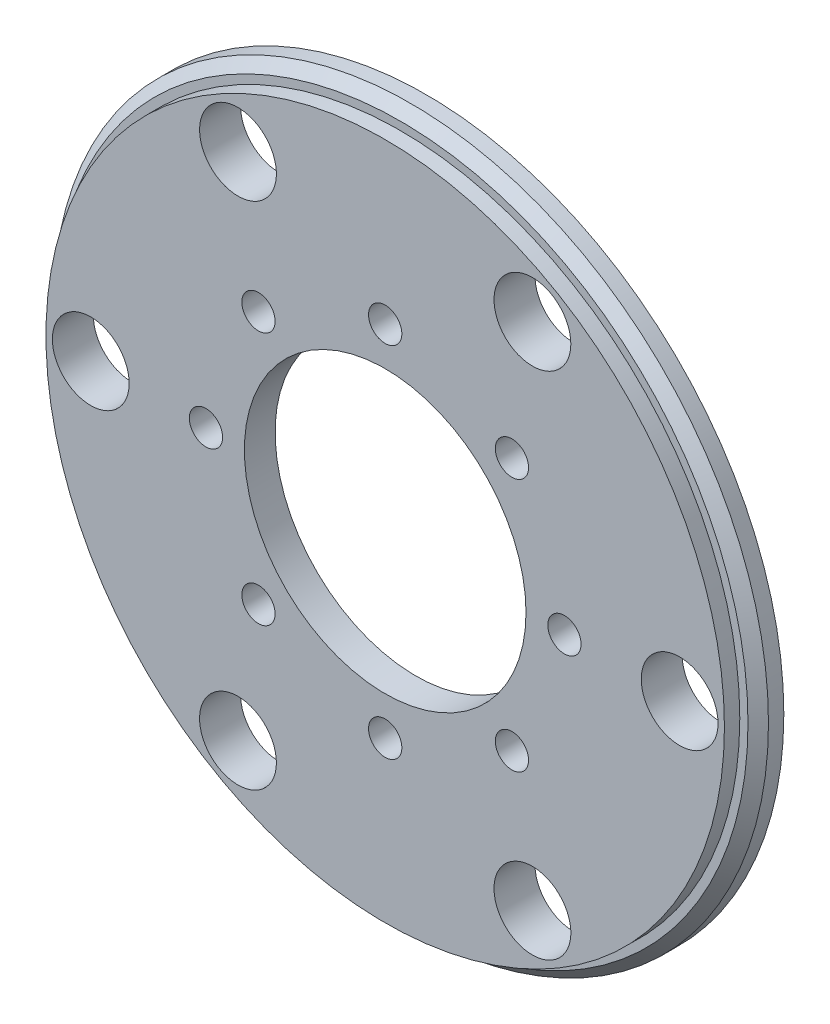
ISO-10303-21;
HEADER;
FILE_DESCRIPTION(('STEP AP214'),'2;1');
FILE_NAME('part.step','',(''),(''),'','','');
FILE_SCHEMA(('AUTOMOTIVE_DESIGN { 1 0 10303 214 1 1 1 1 }'));
ENDSEC;
DATA;
#1=APPLICATION_CONTEXT('core data for automotive mechanical design processes');
#2=APPLICATION_PROTOCOL_DEFINITION('international standard','automotive_design',2000,#1);
#3=PRODUCT_CONTEXT('',#1,'mechanical');
#4=PRODUCT('Part','Part','',(#3));
#5=PRODUCT_RELATED_PRODUCT_CATEGORY('part','',(#4));
#6=PRODUCT_DEFINITION_FORMATION('','',#4);
#7=PRODUCT_DEFINITION_CONTEXT('part definition',#1,'design');
#8=PRODUCT_DEFINITION('design','',#6,#7);
#9=PRODUCT_DEFINITION_SHAPE('','',#8);
#10=(LENGTH_UNIT() NAMED_UNIT(*) SI_UNIT(.MILLI.,.METRE.));
#11=(NAMED_UNIT(*) PLANE_ANGLE_UNIT() SI_UNIT($,.RADIAN.));
#12=(NAMED_UNIT(*) SI_UNIT($,.STERADIAN.) SOLID_ANGLE_UNIT());
#13=UNCERTAINTY_MEASURE_WITH_UNIT(LENGTH_MEASURE(1.E-05),#10,'distance_accuracy_value','');
#14=(GEOMETRIC_REPRESENTATION_CONTEXT(3) GLOBAL_UNCERTAINTY_ASSIGNED_CONTEXT((#13)) GLOBAL_UNIT_ASSIGNED_CONTEXT((#10,
#11,#12)) REPRESENTATION_CONTEXT('',''));
#15=CARTESIAN_POINT('',(0.,0.,0.));
#16=DIRECTION('',(0.,0.,1.));
#17=DIRECTION('',(1.,0.,0.));
#18=AXIS2_PLACEMENT_3D('',#15,#16,#17);
#19=CARTESIAN_POINT('',(0.,0.,-149.));
#20=DIRECTION('',(0.,0.,-1.));
#21=DIRECTION('',(-1.,0.,0.));
#22=AXIS2_PLACEMENT_3D('',#19,#20,#21);
#23=PLANE('',#22);
#24=CARTESIAN_POINT('',(-28.75,-49.796460717605,-149.));
#25=DIRECTION('',(0.,0.,1.));
#26=DIRECTION('',(1.,0.,0.));
#27=AXIS2_PLACEMENT_3D('',#24,#25,#26);
#28=CIRCLE('',#27,7.49999999999999);
#29=CARTESIAN_POINT('',(-21.25,-49.796460717605,-149.));
#30=VERTEX_POINT('',#29);
#31=EDGE_CURVE('E106',#30,#30,#28,.T.);
#32=ORIENTED_EDGE('',*,*,#31,.T.);
#33=EDGE_LOOP('',(#32));
#34=FACE_BOUND('',#33,.T.);
#35=CARTESIAN_POINT('',(-28.75,49.7964607176052,-149.));
#36=DIRECTION('',(0.,0.,-1.));
#37=DIRECTION('',(-1.,0.,0.));
#38=AXIS2_PLACEMENT_3D('',#35,#36,#37);
#39=CIRCLE('',#38,7.5);
#40=CARTESIAN_POINT('',(-36.25,49.7964607176052,-149.));
#41=VERTEX_POINT('',#40);
#42=EDGE_CURVE('E109',#41,#41,#39,.T.);
#43=ORIENTED_EDGE('',*,*,#42,.F.);
#44=EDGE_LOOP('',(#43));
#45=FACE_BOUND('',#44,.T.);
#46=CARTESIAN_POINT('',(28.75,-49.796460717605,-149.));
#47=DIRECTION('',(0.,0.,-1.));
#48=DIRECTION('',(-1.,0.,0.));
#49=AXIS2_PLACEMENT_3D('',#46,#47,#48);
#50=CIRCLE('',#49,7.49999999999999);
#51=CARTESIAN_POINT('',(21.25,-49.796460717605,-149.));
#52=VERTEX_POINT('',#51);
#53=EDGE_CURVE('E115',#52,#52,#50,.T.);
#54=ORIENTED_EDGE('',*,*,#53,.F.);
#55=EDGE_LOOP('',(#54));
#56=FACE_BOUND('',#55,.T.);
#57=CARTESIAN_POINT('',(0.,0.,-149.));
#58=DIRECTION('',(0.,0.,1.));
#59=DIRECTION('',(1.,0.,0.));
#60=AXIS2_PLACEMENT_3D('',#57,#58,#59);
#61=CIRCLE('',#60,40.);
#62=CARTESIAN_POINT('',(40.,0.,-149.));
#63=VERTEX_POINT('',#62);
#64=EDGE_CURVE('E136',#63,#63,#61,.T.);
#65=ORIENTED_EDGE('',*,*,#64,.T.);
#66=EDGE_LOOP('',(#65));
#67=FACE_BOUND('',#66,.T.);
#68=CARTESIAN_POINT('',(0.,0.,-149.));
#69=DIRECTION('',(0.,0.,1.));
#70=DIRECTION('',(1.,0.,0.));
#71=AXIS2_PLACEMENT_3D('',#68,#69,#70);
#72=CIRCLE('',#71,69.85);
#73=CARTESIAN_POINT('',(69.85,0.,-149.));
#74=VERTEX_POINT('',#73);
#75=EDGE_CURVE('E133',#74,#74,#72,.T.);
#76=ORIENTED_EDGE('',*,*,#75,.F.);
#77=EDGE_LOOP('',(#76));
#78=FACE_BOUND('',#77,.T.);
#79=CARTESIAN_POINT('',(57.5,0.,-149.));
#80=DIRECTION('',(0.,0.,1.));
#81=DIRECTION('',(1.,0.,0.));
#82=AXIS2_PLACEMENT_3D('',#79,#80,#81);
#83=CIRCLE('',#82,7.49999999999999);
#84=CARTESIAN_POINT('',(65.,0.,-149.));
#85=VERTEX_POINT('',#84);
#86=EDGE_CURVE('E100',#85,#85,#83,.T.);
#87=ORIENTED_EDGE('',*,*,#86,.T.);
#88=EDGE_LOOP('',(#87));
#89=FACE_BOUND('',#88,.T.);
#90=CARTESIAN_POINT('',(28.75,49.7964607176052,-149.));
#91=DIRECTION('',(0.,0.,1.));
#92=DIRECTION('',(1.,0.,0.));
#93=AXIS2_PLACEMENT_3D('',#90,#91,#92);
#94=CIRCLE('',#93,7.49999999999999);
#95=CARTESIAN_POINT('',(36.25,49.7964607176052,-149.));
#96=VERTEX_POINT('',#95);
#97=EDGE_CURVE('E94',#96,#96,#94,.T.);
#98=ORIENTED_EDGE('',*,*,#97,.T.);
#99=EDGE_LOOP('',(#98));
#100=FACE_BOUND('',#99,.T.);
#101=CARTESIAN_POINT('',(-57.5,0.,-149.));
#102=DIRECTION('',(0.,0.,1.));
#103=DIRECTION('',(1.,0.,0.));
#104=AXIS2_PLACEMENT_3D('',#101,#102,#103);
#105=CIRCLE('',#104,7.49999999999999);
#106=CARTESIAN_POINT('',(-50.,0.,-149.));
#107=VERTEX_POINT('',#106);
#108=EDGE_CURVE('E88',#107,#107,#105,.T.);
#109=ORIENTED_EDGE('',*,*,#108,.T.);
#110=EDGE_LOOP('',(#109));
#111=FACE_BOUND('',#110,.T.);
#112=ADVANCED_FACE('F36',(#34,#45,#56,#67,#78,#89,#100,#111),#23,.T.);
#113=CARTESIAN_POINT('',(0.,0.,-141.));
#114=DIRECTION('',(0.,0.,1.));
#115=DIRECTION('',(1.,0.,0.));
#116=AXIS2_PLACEMENT_3D('',#113,#114,#115);
#117=PLANE('',#116);
#118=CARTESIAN_POINT('',(-35.,-1.11022302462516E-13,-141.));
#119=DIRECTION('',(0.,0.,1.));
#120=DIRECTION('',(1.,0.,0.));
#121=AXIS2_PLACEMENT_3D('',#118,#119,#120);
#122=CIRCLE('',#121,3.25);
#123=CARTESIAN_POINT('',(-31.75,-1.11022302462516E-13,-141.));
#124=VERTEX_POINT('',#123);
#125=EDGE_CURVE('E240',#124,#124,#122,.T.);
#126=ORIENTED_EDGE('',*,*,#125,.F.);
#127=EDGE_LOOP('',(#126));
#128=FACE_BOUND('',#127,.T.);
#129=CARTESIAN_POINT('',(-24.7487373415292,24.7487373415292,-141.));
#130=DIRECTION('',(0.,0.,1.));
#131=DIRECTION('',(1.,0.,0.));
#132=AXIS2_PLACEMENT_3D('',#129,#130,#131);
#133=CIRCLE('',#132,3.25);
#134=CARTESIAN_POINT('',(-21.4987373415292,24.7487373415292,-141.));
#135=VERTEX_POINT('',#134);
#136=EDGE_CURVE('E242',#135,#135,#133,.T.);
#137=ORIENTED_EDGE('',*,*,#136,.F.);
#138=EDGE_LOOP('',(#137));
#139=FACE_BOUND('',#138,.T.);
#140=CARTESIAN_POINT('',(0.,35.,-141.));
#141=DIRECTION('',(0.,0.,1.));
#142=DIRECTION('',(1.,0.,0.));
#143=AXIS2_PLACEMENT_3D('',#140,#141,#142);
#144=CIRCLE('',#143,3.25);
#145=CARTESIAN_POINT('',(3.24999999999999,35.,-141.));
#146=VERTEX_POINT('',#145);
#147=EDGE_CURVE('E250',#146,#146,#144,.T.);
#148=ORIENTED_EDGE('',*,*,#147,.F.);
#149=EDGE_LOOP('',(#148));
#150=FACE_BOUND('',#149,.T.);
#151=CARTESIAN_POINT('',(24.7487373415289,24.7487373415295,-141.));
#152=DIRECTION('',(0.,0.,1.));
#153=DIRECTION('',(1.,0.,0.));
#154=AXIS2_PLACEMENT_3D('',#151,#152,#153);
#155=CIRCLE('',#154,3.25);
#156=CARTESIAN_POINT('',(27.9987373415289,24.7487373415295,-141.));
#157=VERTEX_POINT('',#156);
#158=EDGE_CURVE('E74',#157,#157,#155,.T.);
#159=ORIENTED_EDGE('',*,*,#158,.F.);
#160=EDGE_LOOP('',(#159));
#161=FACE_BOUND('',#160,.T.);
#162=CARTESIAN_POINT('',(35.,3.33066907387547E-13,-141.));
#163=DIRECTION('',(0.,0.,1.));
#164=DIRECTION('',(1.,0.,0.));
#165=AXIS2_PLACEMENT_3D('',#162,#163,#164);
#166=CIRCLE('',#165,3.25);
#167=CARTESIAN_POINT('',(38.25,3.33066907387547E-13,-141.));
#168=VERTEX_POINT('',#167);
#169=EDGE_CURVE('E63',#168,#168,#166,.T.);
#170=ORIENTED_EDGE('',*,*,#169,.F.);
#171=EDGE_LOOP('',(#170));
#172=FACE_BOUND('',#171,.T.);
#173=CARTESIAN_POINT('',(24.7487373415294,-24.7487373415289,-141.));
#174=DIRECTION('',(0.,0.,1.));
#175=DIRECTION('',(1.,0.,0.));
#176=AXIS2_PLACEMENT_3D('',#173,#174,#175);
#177=CIRCLE('',#176,3.25);
#178=CARTESIAN_POINT('',(27.9987373415294,-24.7487373415289,-141.));
#179=VERTEX_POINT('',#178);
#180=EDGE_CURVE('E60',#179,#179,#177,.T.);
#181=ORIENTED_EDGE('',*,*,#180,.F.);
#182=EDGE_LOOP('',(#181));
#183=FACE_BOUND('',#182,.T.);
#184=CARTESIAN_POINT('',(0.,-35.,-141.));
#185=DIRECTION('',(0.,0.,1.));
#186=DIRECTION('',(1.,0.,0.));
#187=AXIS2_PLACEMENT_3D('',#184,#185,#186);
#188=CIRCLE('',#187,3.25);
#189=CARTESIAN_POINT('',(3.25,-35.,-141.));
#190=VERTEX_POINT('',#189);
#191=EDGE_CURVE('E57',#190,#190,#188,.T.);
#192=ORIENTED_EDGE('',*,*,#191,.F.);
#193=EDGE_LOOP('',(#192));
#194=FACE_BOUND('',#193,.T.);
#195=CARTESIAN_POINT('',(-24.748737341529,-24.7487373415293,-141.));
#196=DIRECTION('',(0.,0.,1.));
#197=DIRECTION('',(1.,0.,0.));
#198=AXIS2_PLACEMENT_3D('',#195,#196,#197);
#199=CIRCLE('',#198,3.25);
#200=CARTESIAN_POINT('',(-21.498737341529,-24.7487373415293,-141.));
#201=VERTEX_POINT('',#200);
#202=EDGE_CURVE('E56',#201,#201,#199,.T.);
#203=ORIENTED_EDGE('',*,*,#202,.F.);
#204=EDGE_LOOP('',(#203));
#205=FACE_BOUND('',#204,.T.);
#206=CARTESIAN_POINT('',(-57.5,0.,-141.));
#207=DIRECTION('',(0.,0.,1.));
#208=DIRECTION('',(1.,0.,0.));
#209=AXIS2_PLACEMENT_3D('',#206,#207,#208);
#210=CIRCLE('',#209,7.49999999999999);
#211=CARTESIAN_POINT('',(-50.,0.,-141.));
#212=VERTEX_POINT('',#211);
#213=EDGE_CURVE('E85',#212,#212,#210,.T.);
#214=ORIENTED_EDGE('',*,*,#213,.F.);
#215=EDGE_LOOP('',(#214));
#216=FACE_BOUND('',#215,.T.);
#217=CARTESIAN_POINT('',(28.75,49.7964607176052,-141.));
#218=DIRECTION('',(0.,0.,1.));
#219=DIRECTION('',(1.,0.,0.));
#220=AXIS2_PLACEMENT_3D('',#217,#218,#219);
#221=CIRCLE('',#220,7.49999999999999);
#222=CARTESIAN_POINT('',(36.25,49.7964607176052,-141.));
#223=VERTEX_POINT('',#222);
#224=EDGE_CURVE('E91',#223,#223,#221,.T.);
#225=ORIENTED_EDGE('',*,*,#224,.F.);
#226=EDGE_LOOP('',(#225));
#227=FACE_BOUND('',#226,.T.);
#228=CARTESIAN_POINT('',(57.5,0.,-141.));
#229=DIRECTION('',(0.,0.,1.));
#230=DIRECTION('',(1.,0.,0.));
#231=AXIS2_PLACEMENT_3D('',#228,#229,#230);
#232=CIRCLE('',#231,7.49999999999999);
#233=CARTESIAN_POINT('',(65.,0.,-141.));
#234=VERTEX_POINT('',#233);
#235=EDGE_CURVE('E97',#234,#234,#232,.T.);
#236=ORIENTED_EDGE('',*,*,#235,.F.);
#237=EDGE_LOOP('',(#236));
#238=FACE_BOUND('',#237,.T.);
#239=CARTESIAN_POINT('',(-28.75,-49.796460717605,-141.));
#240=DIRECTION('',(0.,0.,1.));
#241=DIRECTION('',(1.,0.,0.));
#242=AXIS2_PLACEMENT_3D('',#239,#240,#241);
#243=CIRCLE('',#242,7.49999999999999);
#244=CARTESIAN_POINT('',(-21.25,-49.796460717605,-141.));
#245=VERTEX_POINT('',#244);
#246=EDGE_CURVE('E103',#245,#245,#243,.T.);
#247=ORIENTED_EDGE('',*,*,#246,.F.);
#248=EDGE_LOOP('',(#247));
#249=FACE_BOUND('',#248,.T.);
#250=CARTESIAN_POINT('',(28.75,-49.796460717605,-141.));
#251=DIRECTION('',(0.,0.,-1.));
#252=DIRECTION('',(-1.,0.,0.));
#253=AXIS2_PLACEMENT_3D('',#250,#251,#252);
#254=CIRCLE('',#253,7.49999999999999);
#255=CARTESIAN_POINT('',(21.25,-49.796460717605,-141.));
#256=VERTEX_POINT('',#255);
#257=EDGE_CURVE('E118',#256,#256,#254,.T.);
#258=ORIENTED_EDGE('',*,*,#257,.T.);
#259=EDGE_LOOP('',(#258));
#260=FACE_BOUND('',#259,.T.);
#261=CARTESIAN_POINT('',(0.,0.,-141.));
#262=DIRECTION('',(0.,0.,1.));
#263=DIRECTION('',(1.,0.,0.));
#264=AXIS2_PLACEMENT_3D('',#261,#262,#263);
#265=CIRCLE('',#264,66.25);
#266=CARTESIAN_POINT('',(66.25,0.,-141.));
#267=VERTEX_POINT('',#266);
#268=EDGE_CURVE('E127',#267,#267,#265,.T.);
#269=ORIENTED_EDGE('',*,*,#268,.T.);
#270=EDGE_LOOP('',(#269));
#271=FACE_BOUND('',#270,.T.);
#272=CARTESIAN_POINT('',(0.,0.,-141.));
#273=DIRECTION('',(0.,0.,1.));
#274=DIRECTION('',(1.,0.,0.));
#275=AXIS2_PLACEMENT_3D('',#272,#273,#274);
#276=CIRCLE('',#275,27.5);
#277=CARTESIAN_POINT('',(27.5,0.,-141.));
#278=VERTEX_POINT('',#277);
#279=EDGE_CURVE('E124',#278,#278,#276,.T.);
#280=ORIENTED_EDGE('',*,*,#279,.F.);
#281=EDGE_LOOP('',(#280));
#282=FACE_BOUND('',#281,.T.);
#283=CARTESIAN_POINT('',(-28.75,49.7964607176052,-141.));
#284=DIRECTION('',(0.,0.,-1.));
#285=DIRECTION('',(-1.,0.,0.));
#286=AXIS2_PLACEMENT_3D('',#283,#284,#285);
#287=CIRCLE('',#286,7.5);
#288=CARTESIAN_POINT('',(-36.25,49.7964607176052,-141.));
#289=VERTEX_POINT('',#288);
#290=EDGE_CURVE('E112',#289,#289,#287,.T.);
#291=ORIENTED_EDGE('',*,*,#290,.T.);
#292=EDGE_LOOP('',(#291));
#293=FACE_BOUND('',#292,.T.);
#294=ADVANCED_FACE('F146',(#128,#139,#150,#161,#172,#183,#194,#205,#216,#227,#238,#249,#260,
#271,#282,#293),#117,.T.);
#295=CARTESIAN_POINT('',(0.,0.,-147.));
#296=DIRECTION('',(0.,0.,-1.));
#297=DIRECTION('',(-1.,0.,0.));
#298=AXIS2_PLACEMENT_3D('',#295,#296,#297);
#299=PLANE('',#298);
#300=CARTESIAN_POINT('',(-35.,-1.11022302462516E-13,-147.));
#301=DIRECTION('',(0.,0.,-1.));
#302=DIRECTION('',(-1.,0.,0.));
#303=AXIS2_PLACEMENT_3D('',#300,#301,#302);
#304=CIRCLE('',#303,3.25);
#305=CARTESIAN_POINT('',(-38.25,-1.11022302462516E-13,-147.));
#306=VERTEX_POINT('',#305);
#307=EDGE_CURVE('E237',#306,#306,#304,.T.);
#308=ORIENTED_EDGE('',*,*,#307,.F.);
#309=EDGE_LOOP('',(#308));
#310=FACE_BOUND('',#309,.T.);
#311=CARTESIAN_POINT('',(-24.7487373415292,24.7487373415292,-147.));
#312=DIRECTION('',(0.,0.,-1.));
#313=DIRECTION('',(-1.,0.,0.));
#314=AXIS2_PLACEMENT_3D('',#311,#312,#313);
#315=CIRCLE('',#314,3.25);
#316=CARTESIAN_POINT('',(-27.9987373415292,24.7487373415292,-147.));
#317=VERTEX_POINT('',#316);
#318=EDGE_CURVE('E247',#317,#317,#315,.T.);
#319=ORIENTED_EDGE('',*,*,#318,.F.);
#320=EDGE_LOOP('',(#319));
#321=FACE_BOUND('',#320,.T.);
#322=CARTESIAN_POINT('',(0.,35.,-147.));
#323=DIRECTION('',(0.,0.,-1.));
#324=DIRECTION('',(-1.,0.,0.));
#325=AXIS2_PLACEMENT_3D('',#322,#323,#324);
#326=CIRCLE('',#325,3.25);
#327=CARTESIAN_POINT('',(-3.25000000000001,35.,-147.));
#328=VERTEX_POINT('',#327);
#329=EDGE_CURVE('E40',#328,#328,#326,.T.);
#330=ORIENTED_EDGE('',*,*,#329,.F.);
#331=EDGE_LOOP('',(#330));
#332=FACE_BOUND('',#331,.T.);
#333=CARTESIAN_POINT('',(24.7487373415289,24.7487373415295,-147.));
#334=DIRECTION('',(0.,0.,-1.));
#335=DIRECTION('',(-1.,0.,0.));
#336=AXIS2_PLACEMENT_3D('',#333,#334,#335);
#337=CIRCLE('',#336,3.25);
#338=CARTESIAN_POINT('',(21.4987373415289,24.7487373415295,-147.));
#339=VERTEX_POINT('',#338);
#340=EDGE_CURVE('E69',#339,#339,#337,.T.);
#341=ORIENTED_EDGE('',*,*,#340,.F.);
#342=EDGE_LOOP('',(#341));
#343=FACE_BOUND('',#342,.T.);
#344=CARTESIAN_POINT('',(35.,3.33066907387547E-13,-147.));
#345=DIRECTION('',(0.,0.,-1.));
#346=DIRECTION('',(-1.,0.,0.));
#347=AXIS2_PLACEMENT_3D('',#344,#345,#346);
#348=CIRCLE('',#347,3.25);
#349=CARTESIAN_POINT('',(31.75,3.33066907387547E-13,-147.));
#350=VERTEX_POINT('',#349);
#351=EDGE_CURVE('E61',#350,#350,#348,.T.);
#352=ORIENTED_EDGE('',*,*,#351,.F.);
#353=EDGE_LOOP('',(#352));
#354=FACE_BOUND('',#353,.T.);
#355=CARTESIAN_POINT('',(24.7487373415294,-24.7487373415289,-147.));
#356=DIRECTION('',(0.,0.,-1.));
#357=DIRECTION('',(-1.,0.,0.));
#358=AXIS2_PLACEMENT_3D('',#355,#356,#357);
#359=CIRCLE('',#358,3.25);
#360=CARTESIAN_POINT('',(21.4987373415294,-24.7487373415289,-147.));
#361=VERTEX_POINT('',#360);
#362=EDGE_CURVE('E58',#361,#361,#359,.T.);
#363=ORIENTED_EDGE('',*,*,#362,.F.);
#364=EDGE_LOOP('',(#363));
#365=FACE_BOUND('',#364,.T.);
#366=CARTESIAN_POINT('',(0.,-35.,-147.));
#367=DIRECTION('',(0.,0.,-1.));
#368=DIRECTION('',(-1.,0.,0.));
#369=AXIS2_PLACEMENT_3D('',#366,#367,#368);
#370=CIRCLE('',#369,3.25);
#371=CARTESIAN_POINT('',(-3.25,-35.,-147.));
#372=VERTEX_POINT('',#371);
#373=EDGE_CURVE('E53',#372,#372,#370,.T.);
#374=ORIENTED_EDGE('',*,*,#373,.F.);
#375=EDGE_LOOP('',(#374));
#376=FACE_BOUND('',#375,.T.);
#377=CARTESIAN_POINT('',(-24.748737341529,-24.7487373415293,-147.));
#378=DIRECTION('',(0.,0.,-1.));
#379=DIRECTION('',(-1.,0.,0.));
#380=AXIS2_PLACEMENT_3D('',#377,#378,#379);
#381=CIRCLE('',#380,3.25);
#382=CARTESIAN_POINT('',(-27.998737341529,-24.7487373415293,-147.));
#383=VERTEX_POINT('',#382);
#384=EDGE_CURVE('E82',#383,#383,#381,.T.);
#385=ORIENTED_EDGE('',*,*,#384,.F.);
#386=EDGE_LOOP('',(#385));
#387=FACE_BOUND('',#386,.T.);
#388=CARTESIAN_POINT('',(0.,0.,-147.));
#389=DIRECTION('',(0.,0.,1.));
#390=DIRECTION('',(1.,0.,0.));
#391=AXIS2_PLACEMENT_3D('',#388,#389,#390);
#392=CIRCLE('',#391,27.5);
#393=CARTESIAN_POINT('',(27.5,0.,-147.));
#394=VERTEX_POINT('',#393);
#395=EDGE_CURVE('E121',#394,#394,#392,.T.);
#396=ORIENTED_EDGE('',*,*,#395,.T.);
#397=EDGE_LOOP('',(#396));
#398=FACE_BOUND('',#397,.T.);
#399=CARTESIAN_POINT('',(0.,0.,-147.));
#400=DIRECTION('',(0.,0.,1.));
#401=DIRECTION('',(1.,0.,0.));
#402=AXIS2_PLACEMENT_3D('',#399,#400,#401);
#403=CIRCLE('',#402,40.);
#404=CARTESIAN_POINT('',(40.,0.,-147.));
#405=VERTEX_POINT('',#404);
#406=EDGE_CURVE('E49',#405,#405,#403,.T.);
#407=ORIENTED_EDGE('',*,*,#406,.F.);
#408=EDGE_LOOP('',(#407));
#409=FACE_BOUND('',#408,.T.);
#410=ADVANCED_FACE('F144',(#310,#321,#332,#343,#354,#365,#376,#387,#398,#409),#299,.T.);
#411=CARTESIAN_POINT('',(0.,0.,0.));
#412=DIRECTION('',(0.,0.,1.));
#413=DIRECTION('',(1.,0.,0.));
#414=AXIS2_PLACEMENT_3D('',#411,#412,#413);
#415=CYLINDRICAL_SURFACE('',#414,40.);
#416=ORIENTED_EDGE('',*,*,#406,.T.);
#417=EDGE_LOOP('',(#416));
#418=FACE_BOUND('',#417,.T.);
#419=ORIENTED_EDGE('',*,*,#64,.F.);
#420=EDGE_LOOP('',(#419));
#421=FACE_BOUND('',#420,.T.);
#422=ADVANCED_FACE('F141',(#418,#421),#415,.F.);
#423=CARTESIAN_POINT('',(0.,0.,0.));
#424=DIRECTION('',(0.,0.,1.));
#425=DIRECTION('',(1.,0.,0.));
#426=AXIS2_PLACEMENT_3D('',#423,#424,#425);
#427=CYLINDRICAL_SURFACE('',#426,69.85);
#428=CARTESIAN_POINT('',(0.,0.,-146.));
#429=DIRECTION('',(0.,0.,1.));
#430=DIRECTION('',(1.,0.,0.));
#431=AXIS2_PLACEMENT_3D('',#428,#429,#430);
#432=CIRCLE('',#431,69.85);
#433=CARTESIAN_POINT('',(69.85,0.,-146.));
#434=VERTEX_POINT('',#433);
#435=EDGE_CURVE('E11',#434,#434,#432,.F.);
#436=ORIENTED_EDGE('',*,*,#435,.T.);
#437=EDGE_LOOP('',(#436));
#438=FACE_BOUND('',#437,.T.);
#439=ORIENTED_EDGE('',*,*,#75,.T.);
#440=EDGE_LOOP('',(#439));
#441=FACE_BOUND('',#440,.T.);
#442=ADVANCED_FACE('F152',(#438,#441),#427,.T.);
#443=CARTESIAN_POINT('',(0.,0.,-144.));
#444=DIRECTION('',(0.,0.,1.));
#445=DIRECTION('',(1.,0.,0.));
#446=AXIS2_PLACEMENT_3D('',#443,#444,#445);
#447=PLANE('',#446);
#448=CARTESIAN_POINT('',(0.,0.,-144.));
#449=DIRECTION('',(0.,0.,1.));
#450=DIRECTION('',(1.,0.,0.));
#451=AXIS2_PLACEMENT_3D('',#448,#449,#450);
#452=CIRCLE('',#451,67.85);
#453=CARTESIAN_POINT('',(67.85,0.,-144.));
#454=VERTEX_POINT('',#453);
#455=EDGE_CURVE('E44',#454,#454,#452,.T.);
#456=ORIENTED_EDGE('',*,*,#455,.T.);
#457=EDGE_LOOP('',(#456));
#458=FACE_BOUND('',#457,.T.);
#459=CARTESIAN_POINT('',(0.,0.,-144.));
#460=DIRECTION('',(0.,0.,1.));
#461=DIRECTION('',(1.,0.,0.));
#462=AXIS2_PLACEMENT_3D('',#459,#460,#461);
#463=CIRCLE('',#462,66.25);
#464=CARTESIAN_POINT('',(66.25,0.,-144.));
#465=VERTEX_POINT('',#464);
#466=EDGE_CURVE('E130',#465,#465,#463,.T.);
#467=ORIENTED_EDGE('',*,*,#466,.F.);
#468=EDGE_LOOP('',(#467));
#469=FACE_BOUND('',#468,.T.);
#470=ADVANCED_FACE('F167',(#458,#469),#447,.T.);
#471=CARTESIAN_POINT('',(0.,0.,0.));
#472=DIRECTION('',(0.,0.,1.));
#473=DIRECTION('',(1.,0.,0.));
#474=AXIS2_PLACEMENT_3D('',#471,#472,#473);
#475=CYLINDRICAL_SURFACE('',#474,66.25);
#476=ORIENTED_EDGE('',*,*,#466,.T.);
#477=EDGE_LOOP('',(#476));
#478=FACE_BOUND('',#477,.T.);
#479=ORIENTED_EDGE('',*,*,#268,.F.);
#480=EDGE_LOOP('',(#479));
#481=FACE_BOUND('',#480,.T.);
#482=ADVANCED_FACE('F170',(#478,#481),#475,.T.);
#483=CARTESIAN_POINT('',(0.,0.,0.));
#484=DIRECTION('',(0.,0.,1.));
#485=DIRECTION('',(1.,0.,0.));
#486=AXIS2_PLACEMENT_3D('',#483,#484,#485);
#487=CYLINDRICAL_SURFACE('',#486,27.5);
#488=ORIENTED_EDGE('',*,*,#279,.T.);
#489=EDGE_LOOP('',(#488));
#490=FACE_BOUND('',#489,.T.);
#491=ORIENTED_EDGE('',*,*,#395,.F.);
#492=EDGE_LOOP('',(#491));
#493=FACE_BOUND('',#492,.T.);
#494=ADVANCED_FACE('F173',(#490,#493),#487,.F.);
#495=CARTESIAN_POINT('',(28.75,-49.796460717605,-149.));
#496=DIRECTION('',(0.,0.,-1.));
#497=DIRECTION('',(-1.,0.,0.));
#498=AXIS2_PLACEMENT_3D('',#495,#496,#497);
#499=CYLINDRICAL_SURFACE('',#498,7.49999999999999);
#500=ORIENTED_EDGE('',*,*,#257,.F.);
#501=EDGE_LOOP('',(#500));
#502=FACE_BOUND('',#501,.T.);
#503=ORIENTED_EDGE('',*,*,#53,.T.);
#504=EDGE_LOOP('',(#503));
#505=FACE_BOUND('',#504,.T.);
#506=ADVANCED_FACE('F178',(#502,#505),#499,.F.);
#507=CARTESIAN_POINT('',(-28.75,49.7964607176052,-149.));
#508=DIRECTION('',(0.,0.,-1.));
#509=DIRECTION('',(-1.,0.,0.));
#510=AXIS2_PLACEMENT_3D('',#507,#508,#509);
#511=CYLINDRICAL_SURFACE('',#510,7.5);
#512=ORIENTED_EDGE('',*,*,#290,.F.);
#513=EDGE_LOOP('',(#512));
#514=FACE_BOUND('',#513,.T.);
#515=ORIENTED_EDGE('',*,*,#42,.T.);
#516=EDGE_LOOP('',(#515));
#517=FACE_BOUND('',#516,.T.);
#518=ADVANCED_FACE('F182',(#514,#517),#511,.F.);
#519=CARTESIAN_POINT('',(0.,0.,-144.));
#520=DIRECTION('',(0.,0.,-1.));
#521=DIRECTION('',(-1.,0.,0.));
#522=AXIS2_PLACEMENT_3D('',#519,#520,#521);
#523=CONICAL_SURFACE('',#522,67.85,0.785398163397441);
#524=ORIENTED_EDGE('',*,*,#435,.F.);
#525=EDGE_LOOP('',(#524));
#526=FACE_BOUND('',#525,.T.);
#527=ORIENTED_EDGE('',*,*,#455,.F.);
#528=EDGE_LOOP('',(#527));
#529=FACE_BOUND('',#528,.T.);
#530=ADVANCED_FACE('F38',(#526,#529),#523,.T.);
#531=CARTESIAN_POINT('',(-28.75,-49.796460717605,-141.));
#532=DIRECTION('',(0.,0.,1.));
#533=DIRECTION('',(1.,0.,0.));
#534=AXIS2_PLACEMENT_3D('',#531,#532,#533);
#535=CYLINDRICAL_SURFACE('',#534,7.49999999999999);
#536=ORIENTED_EDGE('',*,*,#31,.F.);
#537=EDGE_LOOP('',(#536));
#538=FACE_BOUND('',#537,.T.);
#539=ORIENTED_EDGE('',*,*,#246,.T.);
#540=EDGE_LOOP('',(#539));
#541=FACE_BOUND('',#540,.T.);
#542=ADVANCED_FACE('F187',(#538,#541),#535,.F.);
#543=CARTESIAN_POINT('',(57.5,0.,-141.));
#544=DIRECTION('',(0.,0.,1.));
#545=DIRECTION('',(1.,0.,0.));
#546=AXIS2_PLACEMENT_3D('',#543,#544,#545);
#547=CYLINDRICAL_SURFACE('',#546,7.49999999999999);
#548=ORIENTED_EDGE('',*,*,#86,.F.);
#549=EDGE_LOOP('',(#548));
#550=FACE_BOUND('',#549,.T.);
#551=ORIENTED_EDGE('',*,*,#235,.T.);
#552=EDGE_LOOP('',(#551));
#553=FACE_BOUND('',#552,.T.);
#554=ADVANCED_FACE('F190',(#550,#553),#547,.F.);
#555=CARTESIAN_POINT('',(28.75,49.7964607176052,-141.));
#556=DIRECTION('',(0.,0.,1.));
#557=DIRECTION('',(1.,0.,0.));
#558=AXIS2_PLACEMENT_3D('',#555,#556,#557);
#559=CYLINDRICAL_SURFACE('',#558,7.49999999999999);
#560=ORIENTED_EDGE('',*,*,#97,.F.);
#561=EDGE_LOOP('',(#560));
#562=FACE_BOUND('',#561,.T.);
#563=ORIENTED_EDGE('',*,*,#224,.T.);
#564=EDGE_LOOP('',(#563));
#565=FACE_BOUND('',#564,.T.);
#566=ADVANCED_FACE('F194',(#562,#565),#559,.F.);
#567=CARTESIAN_POINT('',(-57.5,0.,-141.));
#568=DIRECTION('',(0.,0.,1.));
#569=DIRECTION('',(1.,0.,0.));
#570=AXIS2_PLACEMENT_3D('',#567,#568,#569);
#571=CYLINDRICAL_SURFACE('',#570,7.49999999999999);
#572=ORIENTED_EDGE('',*,*,#108,.F.);
#573=EDGE_LOOP('',(#572));
#574=FACE_BOUND('',#573,.T.);
#575=ORIENTED_EDGE('',*,*,#213,.T.);
#576=EDGE_LOOP('',(#575));
#577=FACE_BOUND('',#576,.T.);
#578=ADVANCED_FACE('F198',(#574,#577),#571,.F.);
#579=CARTESIAN_POINT('',(-24.748737341529,-24.7487373415293,-141.));
#580=DIRECTION('',(0.,0.,1.));
#581=DIRECTION('',(1.,0.,0.));
#582=AXIS2_PLACEMENT_3D('',#579,#580,#581);
#583=CYLINDRICAL_SURFACE('',#582,3.25);
#584=ORIENTED_EDGE('',*,*,#384,.T.);
#585=EDGE_LOOP('',(#584));
#586=FACE_BOUND('',#585,.T.);
#587=ORIENTED_EDGE('',*,*,#202,.T.);
#588=EDGE_LOOP('',(#587));
#589=FACE_BOUND('',#588,.T.);
#590=ADVANCED_FACE('F202',(#586,#589),#583,.F.);
#591=CARTESIAN_POINT('',(0.,-35.,-141.));
#592=DIRECTION('',(0.,0.,1.));
#593=DIRECTION('',(1.,0.,0.));
#594=AXIS2_PLACEMENT_3D('',#591,#592,#593);
#595=CYLINDRICAL_SURFACE('',#594,3.25);
#596=ORIENTED_EDGE('',*,*,#373,.T.);
#597=EDGE_LOOP('',(#596));
#598=FACE_BOUND('',#597,.T.);
#599=ORIENTED_EDGE('',*,*,#191,.T.);
#600=EDGE_LOOP('',(#599));
#601=FACE_BOUND('',#600,.T.);
#602=ADVANCED_FACE('F206',(#598,#601),#595,.F.);
#603=CARTESIAN_POINT('',(24.7487373415294,-24.7487373415289,-141.));
#604=DIRECTION('',(0.,0.,1.));
#605=DIRECTION('',(1.,0.,0.));
#606=AXIS2_PLACEMENT_3D('',#603,#604,#605);
#607=CYLINDRICAL_SURFACE('',#606,3.25);
#608=ORIENTED_EDGE('',*,*,#362,.T.);
#609=EDGE_LOOP('',(#608));
#610=FACE_BOUND('',#609,.T.);
#611=ORIENTED_EDGE('',*,*,#180,.T.);
#612=EDGE_LOOP('',(#611));
#613=FACE_BOUND('',#612,.T.);
#614=ADVANCED_FACE('F210',(#610,#613),#607,.F.);
#615=CARTESIAN_POINT('',(35.,3.33066907387547E-13,-141.));
#616=DIRECTION('',(0.,0.,1.));
#617=DIRECTION('',(1.,0.,0.));
#618=AXIS2_PLACEMENT_3D('',#615,#616,#617);
#619=CYLINDRICAL_SURFACE('',#618,3.25);
#620=ORIENTED_EDGE('',*,*,#351,.T.);
#621=EDGE_LOOP('',(#620));
#622=FACE_BOUND('',#621,.T.);
#623=ORIENTED_EDGE('',*,*,#169,.T.);
#624=EDGE_LOOP('',(#623));
#625=FACE_BOUND('',#624,.T.);
#626=ADVANCED_FACE('F214',(#622,#625),#619,.F.);
#627=CARTESIAN_POINT('',(24.7487373415289,24.7487373415295,-141.));
#628=DIRECTION('',(0.,0.,1.));
#629=DIRECTION('',(1.,0.,0.));
#630=AXIS2_PLACEMENT_3D('',#627,#628,#629);
#631=CYLINDRICAL_SURFACE('',#630,3.25);
#632=ORIENTED_EDGE('',*,*,#340,.T.);
#633=EDGE_LOOP('',(#632));
#634=FACE_BOUND('',#633,.T.);
#635=ORIENTED_EDGE('',*,*,#158,.T.);
#636=EDGE_LOOP('',(#635));
#637=FACE_BOUND('',#636,.T.);
#638=ADVANCED_FACE('F218',(#634,#637),#631,.F.);
#639=CARTESIAN_POINT('',(0.,35.,-141.));
#640=DIRECTION('',(0.,0.,1.));
#641=DIRECTION('',(1.,0.,0.));
#642=AXIS2_PLACEMENT_3D('',#639,#640,#641);
#643=CYLINDRICAL_SURFACE('',#642,3.25);
#644=ORIENTED_EDGE('',*,*,#329,.T.);
#645=EDGE_LOOP('',(#644));
#646=FACE_BOUND('',#645,.T.);
#647=ORIENTED_EDGE('',*,*,#147,.T.);
#648=EDGE_LOOP('',(#647));
#649=FACE_BOUND('',#648,.T.);
#650=ADVANCED_FACE('F221',(#646,#649),#643,.F.);
#651=CARTESIAN_POINT('',(-24.7487373415292,24.7487373415292,-141.));
#652=DIRECTION('',(0.,0.,1.));
#653=DIRECTION('',(1.,0.,0.));
#654=AXIS2_PLACEMENT_3D('',#651,#652,#653);
#655=CYLINDRICAL_SURFACE('',#654,3.25);
#656=ORIENTED_EDGE('',*,*,#318,.T.);
#657=EDGE_LOOP('',(#656));
#658=FACE_BOUND('',#657,.T.);
#659=ORIENTED_EDGE('',*,*,#136,.T.);
#660=EDGE_LOOP('',(#659));
#661=FACE_BOUND('',#660,.T.);
#662=ADVANCED_FACE('F225',(#658,#661),#655,.F.);
#663=CARTESIAN_POINT('',(-35.,-1.11022302462516E-13,-141.));
#664=DIRECTION('',(0.,0.,1.));
#665=DIRECTION('',(1.,0.,0.));
#666=AXIS2_PLACEMENT_3D('',#663,#664,#665);
#667=CYLINDRICAL_SURFACE('',#666,3.25);
#668=ORIENTED_EDGE('',*,*,#307,.T.);
#669=EDGE_LOOP('',(#668));
#670=FACE_BOUND('',#669,.T.);
#671=ORIENTED_EDGE('',*,*,#125,.T.);
#672=EDGE_LOOP('',(#671));
#673=FACE_BOUND('',#672,.T.);
#674=ADVANCED_FACE('F229',(#670,#673),#667,.F.);
#675=CLOSED_SHELL('',(#112,#294,#410,#422,#442,#470,#482,#494,#506,#518,#530,#542,#554,#566,
#578,#590,#602,#614,#626,#638,#650,#662,#674));
#676=MANIFOLD_SOLID_BREP('B2',#675);
#677=ADVANCED_BREP_SHAPE_REPRESENTATION('',(#18,#676),#14);
#678=SHAPE_DEFINITION_REPRESENTATION(#9,#677);
ENDSEC;
END-ISO-10303-21;
